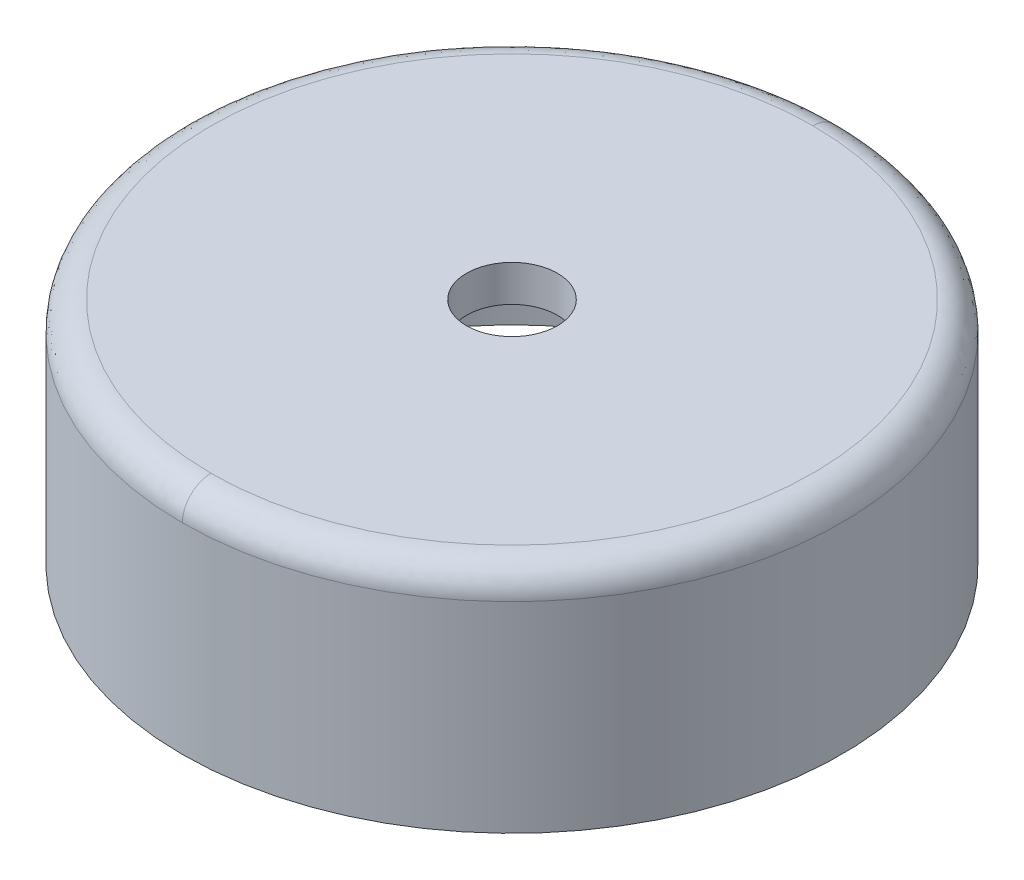
ISO-10303-21;
HEADER;
FILE_DESCRIPTION(('STEP AP214'),'2;1');
FILE_NAME('part.step','',(''),(''),'','','');
FILE_SCHEMA(('AUTOMOTIVE_DESIGN { 1 0 10303 214 1 1 1 1 }'));
ENDSEC;
DATA;
#1=APPLICATION_CONTEXT('core data for automotive mechanical design processes');
#2=APPLICATION_PROTOCOL_DEFINITION('international standard','automotive_design',2000,#1);
#3=PRODUCT_CONTEXT('',#1,'mechanical');
#4=PRODUCT('Part','Part','',(#3));
#5=PRODUCT_RELATED_PRODUCT_CATEGORY('part','',(#4));
#6=PRODUCT_DEFINITION_FORMATION('','',#4);
#7=PRODUCT_DEFINITION_CONTEXT('part definition',#1,'design');
#8=PRODUCT_DEFINITION('design','',#6,#7);
#9=PRODUCT_DEFINITION_SHAPE('','',#8);
#10=(LENGTH_UNIT() NAMED_UNIT(*) SI_UNIT(.MILLI.,.METRE.));
#11=(NAMED_UNIT(*) PLANE_ANGLE_UNIT() SI_UNIT($,.RADIAN.));
#12=(NAMED_UNIT(*) SI_UNIT($,.STERADIAN.) SOLID_ANGLE_UNIT());
#13=UNCERTAINTY_MEASURE_WITH_UNIT(LENGTH_MEASURE(1.E-05),#10,'distance_accuracy_value','');
#14=(GEOMETRIC_REPRESENTATION_CONTEXT(3) GLOBAL_UNCERTAINTY_ASSIGNED_CONTEXT((#13)) GLOBAL_UNIT_ASSIGNED_CONTEXT((#10,
#11,#12)) REPRESENTATION_CONTEXT('',''));
#15=CARTESIAN_POINT('',(0.,0.,0.));
#16=DIRECTION('',(0.,0.,1.));
#17=DIRECTION('',(1.,0.,0.));
#18=AXIS2_PLACEMENT_3D('',#15,#16,#17);
#19=CARTESIAN_POINT('',(-58.19,0.,-58.19));
#20=DIRECTION('',(0.,1.,0.));
#21=DIRECTION('',(0.,0.,1.));
#22=AXIS2_PLACEMENT_3D('',#19,#20,#21);
#23=PLANE('',#22);
#24=CARTESIAN_POINT('',(0.,0.,0.));
#25=DIRECTION('',(0.,-1.,0.));
#26=DIRECTION('',(0.,0.,-1.));
#27=AXIS2_PLACEMENT_3D('',#24,#25,#26);
#28=CIRCLE('',#27,51.15);
#29=CARTESIAN_POINT('',(0.,0.,-51.15));
#30=VERTEX_POINT('',#29);
#31=EDGE_CURVE('E57',#30,#30,#28,.T.);
#32=ORIENTED_EDGE('',*,*,#31,.F.);
#33=EDGE_LOOP('',(#32));
#34=FACE_BOUND('',#33,.T.);
#35=CARTESIAN_POINT('',(0.,0.,0.));
#36=DIRECTION('',(0.,-1.,0.));
#37=DIRECTION('',(0.,0.,-1.));
#38=AXIS2_PLACEMENT_3D('',#35,#36,#37);
#39=CIRCLE('',#38,57.5);
#40=CARTESIAN_POINT('',(0.,0.,-57.5));
#41=VERTEX_POINT('',#40);
#42=EDGE_CURVE('E22',#41,#41,#39,.T.);
#43=ORIENTED_EDGE('',*,*,#42,.T.);
#44=EDGE_LOOP('',(#43));
#45=FACE_BOUND('',#44,.T.);
#46=ADVANCED_FACE('F17',(#34,#45),#23,.F.);
#47=CARTESIAN_POINT('',(0.,35.,0.));
#48=DIRECTION('',(0.,-1.,0.));
#49=DIRECTION('',(0.,0.,-1.));
#50=AXIS2_PLACEMENT_3D('',#47,#48,#49);
#51=CYLINDRICAL_SURFACE('',#50,57.5);
#52=CARTESIAN_POINT('',(0.,35.0000000025078,0.));
#53=DIRECTION('',(0.,1.,0.));
#54=DIRECTION('',(-1.,0.,0.));
#55=AXIS2_PLACEMENT_3D('',#52,#53,#54);
#56=CIRCLE('',#55,57.4999999997125);
#57=CARTESIAN_POINT('',(-2.58156681732607E-09,35.0000000025078,-57.4999999997843));
#58=VERTEX_POINT('',#57);
#59=CARTESIAN_POINT('',(-5.89672356981577E-09,35.0000000018809,57.4999999997843));
#60=VERTEX_POINT('',#59);
#61=EDGE_CURVE('E46',#58,#60,#56,.T.);
#62=ORIENTED_EDGE('',*,*,#61,.F.);
#63=CARTESIAN_POINT('',(0.,35.0000000025078,0.));
#64=DIRECTION('',(0.,1.,0.));
#65=DIRECTION('',(-1.,0.,0.));
#66=AXIS2_PLACEMENT_3D('',#63,#64,#65);
#67=CIRCLE('',#66,57.4999999997125);
#68=EDGE_CURVE('E51',#60,#58,#67,.T.);
#69=ORIENTED_EDGE('',*,*,#68,.F.);
#70=EDGE_LOOP('',(#62,#69));
#71=FACE_BOUND('',#70,.T.);
#72=ORIENTED_EDGE('',*,*,#42,.F.);
#73=EDGE_LOOP('',(#72));
#74=FACE_BOUND('',#73,.T.);
#75=ADVANCED_FACE('F63',(#71,#74),#51,.T.);
#76=CARTESIAN_POINT('',(0.,33.65,0.));
#77=DIRECTION('',(0.,-1.,0.));
#78=DIRECTION('',(0.,0.,-1.));
#79=AXIS2_PLACEMENT_3D('',#76,#77,#78);
#80=CYLINDRICAL_SURFACE('',#79,51.15);
#81=ORIENTED_EDGE('',*,*,#31,.T.);
#82=EDGE_LOOP('',(#81));
#83=FACE_BOUND('',#82,.T.);
#84=CARTESIAN_POINT('',(0.,33.65,0.));
#85=DIRECTION('',(0.,-1.,0.));
#86=DIRECTION('',(0.,0.,-1.));
#87=AXIS2_PLACEMENT_3D('',#84,#85,#86);
#88=CIRCLE('',#87,51.15);
#89=CARTESIAN_POINT('',(0.,33.65,-51.15));
#90=VERTEX_POINT('',#89);
#91=EDGE_CURVE('E66',#90,#90,#88,.F.);
#92=ORIENTED_EDGE('',*,*,#91,.T.);
#93=EDGE_LOOP('',(#92));
#94=FACE_BOUND('',#93,.T.);
#95=ADVANCED_FACE('F100',(#83,#94),#80,.F.);
#96=CARTESIAN_POINT('',(0.,39.975020826,52.000832917));
#97=CARTESIAN_POINT('',(104.001665834,39.975020826,52.000832917));
#98=CARTESIAN_POINT('',(104.001665834,39.975020826,-52.000832917));
#99=CARTESIAN_POINT('',(0.,39.975020826,-52.000832917));
#100=CARTESIAN_POINT('',(0.,40.316102114,55.400268826));
#101=CARTESIAN_POINT('',(110.800537652,40.316102114,55.400268826));
#102=CARTESIAN_POINT('',(110.800537652,40.316102114,-55.400268826));
#103=CARTESIAN_POINT('',(0.,40.316102114,-55.400268826));
#104=CARTESIAN_POINT('',(0.,37.900268826,57.816102114));
#105=CARTESIAN_POINT('',(115.632204227,37.900268826,57.816102114));
#106=CARTESIAN_POINT('',(115.632204227,37.900268826,-57.816102114));
#107=CARTESIAN_POINT('',(0.,37.900268826,-57.816102114));
#108=CARTESIAN_POINT('',(0.,34.500832917,57.475020826));
#109=CARTESIAN_POINT('',(114.950041653,34.500832917,57.475020826));
#110=CARTESIAN_POINT('',(114.950041653,34.500832917,-57.475020826));
#111=CARTESIAN_POINT('',(0.,34.500832917,-57.475020826));
#112=(BOUNDED_SURFACE() B_SPLINE_SURFACE(3,3,((#96,#97,#98,#99),(#100,#101,#102,#103),(#104,
#105,#106,#107),(#108,#109,#110,#111)),.UNSPECIFIED.,.F.,.F.,
.F.) B_SPLINE_SURFACE_WITH_KNOTS((4,4),(4,4),(0.,1.),(0.,1.),
.UNSPECIFIED.) GEOMETRIC_REPRESENTATION_ITEM() RATIONAL_B_SPLINE_SURFACE(((1.,0.333333333333333,
0.333333333333333,1.),(0.755320871117972,0.251773623705991,0.251773623705991,0.755320871117972),
(0.755320871117972,0.251773623705991,0.251773623705991,0.755320871117972),(1.,0.333333333333333,
0.333333333333333,1.))) REPRESENTATION_ITEM('') SURFACE());
#113=CARTESIAN_POINT('',(0.,39.9999999997124,-52.50000000251));
#114=CARTESIAN_POINT('',(105.000000005011,39.9999999997124,-52.50000000251));
#115=CARTESIAN_POINT('',(105.000000005011,39.9999999997124,52.50000000251));
#116=CARTESIAN_POINT('',(0.,39.9999999997124,52.50000000251));
#117=(BOUNDED_CURVE() B_SPLINE_CURVE(3,(#113,#114,#115,#116),.UNSPECIFIED.,.F.,
.F.) B_SPLINE_CURVE_WITH_KNOTS((4,4),(0.,1.),
.UNSPECIFIED.) CURVE() GEOMETRIC_REPRESENTATION_ITEM() RATIONAL_B_SPLINE_CURVE((0.95657830216582,
0.318859434055273,0.318859434055273,0.95657830216582)) REPRESENTATION_ITEM(''));
#118=CARTESIAN_POINT('',(0.,39.9999999998275,52.4999999910896));
#119=VERTEX_POINT('',#118);
#120=CARTESIAN_POINT('',(0.,39.9999999998275,-52.4999999910896));
#121=VERTEX_POINT('',#120);
#122=EDGE_CURVE('E36',#119,#121,#117,.F.);
#123=CARTESIAN_POINT('',(0.,39.975020826,52.000832917));
#124=CARTESIAN_POINT('',(0.,40.316102114,55.400268826));
#125=CARTESIAN_POINT('',(0.,37.900268826,57.816102114));
#126=CARTESIAN_POINT('',(0.,34.500832917,57.475020826));
#127=(BOUNDED_CURVE() B_SPLINE_CURVE(3,(#123,#124,#125,#126),.UNSPECIFIED.,.F.,
.F.) B_SPLINE_CURVE_WITH_KNOTS((4,4),(0.,1.),
.UNSPECIFIED.) CURVE() GEOMETRIC_REPRESENTATION_ITEM() RATIONAL_B_SPLINE_CURVE((1.,
0.755320871117972,0.755320871117972,1.)) REPRESENTATION_ITEM(''));
#128=EDGE_CURVE('E55',#60,#119,#127,.F.);
#129=CARTESIAN_POINT('',(0.,39.975020826,-52.000832917));
#130=CARTESIAN_POINT('',(0.,40.316102114,-55.400268826));
#131=CARTESIAN_POINT('',(0.,37.900268826,-57.816102114));
#132=CARTESIAN_POINT('',(0.,34.500832917,-57.475020826));
#133=(BOUNDED_CURVE() B_SPLINE_CURVE(3,(#129,#130,#131,#132),.UNSPECIFIED.,.F.,
.F.) B_SPLINE_CURVE_WITH_KNOTS((4,4),(0.,1.),
.UNSPECIFIED.) CURVE() GEOMETRIC_REPRESENTATION_ITEM() RATIONAL_B_SPLINE_CURVE((1.,
0.755320871117972,0.755320871117972,1.)) REPRESENTATION_ITEM(''));
#134=EDGE_CURVE('E53',#121,#58,#133,.T.);
#135=ORIENTED_EDGE('',*,*,#122,.F.);
#136=ORIENTED_EDGE('',*,*,#128,.F.);
#137=ORIENTED_EDGE('',*,*,#68,.T.);
#138=ORIENTED_EDGE('',*,*,#134,.F.);
#139=EDGE_LOOP('',(#135,#136,#137,#138));
#140=FACE_BOUND('',#139,.T.);
#141=ADVANCED_FACE('F52',(#140),#112,.T.);
#142=CARTESIAN_POINT('',(0.,39.975020826,-52.000832917));
#143=CARTESIAN_POINT('',(-104.001665834,39.975020826,-52.000832917));
#144=CARTESIAN_POINT('',(-104.001665834,39.975020826,52.000832917));
#145=CARTESIAN_POINT('',(0.,39.975020826,52.000832917));
#146=CARTESIAN_POINT('',(0.,40.316102114,-55.400268826));
#147=CARTESIAN_POINT('',(-110.800537652,40.316102114,-55.400268826));
#148=CARTESIAN_POINT('',(-110.800537652,40.316102114,55.400268826));
#149=CARTESIAN_POINT('',(0.,40.316102114,55.400268826));
#150=CARTESIAN_POINT('',(0.,37.900268826,-57.816102114));
#151=CARTESIAN_POINT('',(-115.632204227,37.900268826,-57.816102114));
#152=CARTESIAN_POINT('',(-115.632204227,37.900268826,57.816102114));
#153=CARTESIAN_POINT('',(0.,37.900268826,57.816102114));
#154=CARTESIAN_POINT('',(0.,34.500832917,-57.475020826));
#155=CARTESIAN_POINT('',(-114.950041653,34.500832917,-57.475020826));
#156=CARTESIAN_POINT('',(-114.950041653,34.500832917,57.475020826));
#157=CARTESIAN_POINT('',(0.,34.500832917,57.475020826));
#158=(BOUNDED_SURFACE() B_SPLINE_SURFACE(3,3,((#142,#143,#144,#145),(#146,#147,#148,#149),(#150,
#151,#152,#153),(#154,#155,#156,#157)),.UNSPECIFIED.,.F.,.F.,
.F.) B_SPLINE_SURFACE_WITH_KNOTS((4,4),(4,4),(0.,1.),(0.,1.),
.UNSPECIFIED.) GEOMETRIC_REPRESENTATION_ITEM() RATIONAL_B_SPLINE_SURFACE(((1.,0.333333333333333,
0.333333333333333,1.),(0.755320871117972,0.251773623705991,0.251773623705991,0.755320871117972),
(0.755320871117972,0.251773623705991,0.251773623705991,0.755320871117972),(1.,0.333333333333333,
0.333333333333333,1.))) REPRESENTATION_ITEM('') SURFACE());
#159=CARTESIAN_POINT('',(0.,39.9999999997125,52.50000000251));
#160=CARTESIAN_POINT('',(-105.000000005011,39.9999999997125,52.50000000251));
#161=CARTESIAN_POINT('',(-105.000000005011,39.9999999997125,-52.50000000251));
#162=CARTESIAN_POINT('',(0.,39.9999999997125,-52.50000000251));
#163=(BOUNDED_CURVE() B_SPLINE_CURVE(3,(#159,#160,#161,#162),.UNSPECIFIED.,.F.,
.F.) B_SPLINE_CURVE_WITH_KNOTS((4,4),(0.,1.),
.UNSPECIFIED.) CURVE() GEOMETRIC_REPRESENTATION_ITEM() RATIONAL_B_SPLINE_CURVE((0.95657830216582,
0.318859434055273,0.318859434055273,0.95657830216582)) REPRESENTATION_ITEM(''));
#164=EDGE_CURVE('E60',#121,#119,#163,.F.);
#165=ORIENTED_EDGE('',*,*,#128,.T.);
#166=ORIENTED_EDGE('',*,*,#164,.F.);
#167=ORIENTED_EDGE('',*,*,#134,.T.);
#168=ORIENTED_EDGE('',*,*,#61,.T.);
#169=EDGE_LOOP('',(#165,#166,#167,#168));
#170=FACE_BOUND('',#169,.T.);
#171=ADVANCED_FACE('F59',(#170),#158,.T.);
#172=CARTESIAN_POINT('',(-51.7638,33.65,-51.7638));
#173=DIRECTION('',(0.,1.,0.));
#174=DIRECTION('',(0.,0.,1.));
#175=AXIS2_PLACEMENT_3D('',#172,#173,#174);
#176=PLANE('',#175);
#177=CARTESIAN_POINT('',(0.,33.65,0.));
#178=DIRECTION('',(0.,1.,0.));
#179=DIRECTION('',(0.,0.,1.));
#180=AXIS2_PLACEMENT_3D('',#177,#178,#179);
#181=CIRCLE('',#180,7.9375);
#182=CARTESIAN_POINT('',(0.,33.65,7.9375));
#183=VERTEX_POINT('',#182);
#184=EDGE_CURVE('E28',#183,#183,#181,.F.);
#185=ORIENTED_EDGE('',*,*,#184,.F.);
#186=EDGE_LOOP('',(#185));
#187=FACE_BOUND('',#186,.T.);
#188=ORIENTED_EDGE('',*,*,#91,.F.);
#189=EDGE_LOOP('',(#188));
#190=FACE_BOUND('',#189,.T.);
#191=ADVANCED_FACE('F117',(#187,#190),#176,.F.);
#192=CARTESIAN_POINT('',(-53.13,40.,-53.13));
#193=DIRECTION('',(0.,1.,0.));
#194=DIRECTION('',(0.,0.,1.));
#195=AXIS2_PLACEMENT_3D('',#192,#193,#194);
#196=PLANE('',#195);
#197=CARTESIAN_POINT('',(0.,40.,0.));
#198=DIRECTION('',(0.,1.,0.));
#199=DIRECTION('',(0.,0.,1.));
#200=AXIS2_PLACEMENT_3D('',#197,#198,#199);
#201=CIRCLE('',#200,7.9375);
#202=CARTESIAN_POINT('',(0.,40.,7.9375));
#203=VERTEX_POINT('',#202);
#204=EDGE_CURVE('E11',#203,#203,#201,.T.);
#205=ORIENTED_EDGE('',*,*,#204,.F.);
#206=EDGE_LOOP('',(#205));
#207=FACE_BOUND('',#206,.T.);
#208=ORIENTED_EDGE('',*,*,#122,.T.);
#209=ORIENTED_EDGE('',*,*,#164,.T.);
#210=EDGE_LOOP('',(#208,#209));
#211=FACE_BOUND('',#210,.T.);
#212=ADVANCED_FACE('F19',(#207,#211),#196,.T.);
#213=CARTESIAN_POINT('',(0.,33.65,0.));
#214=DIRECTION('',(0.,1.,0.));
#215=DIRECTION('',(0.,0.,1.));
#216=AXIS2_PLACEMENT_3D('',#213,#214,#215);
#217=CYLINDRICAL_SURFACE('',#216,7.9375);
#218=ORIENTED_EDGE('',*,*,#204,.T.);
#219=EDGE_LOOP('',(#218));
#220=FACE_BOUND('',#219,.T.);
#221=ORIENTED_EDGE('',*,*,#184,.T.);
#222=EDGE_LOOP('',(#221));
#223=FACE_BOUND('',#222,.T.);
#224=ADVANCED_FACE('F110',(#220,#223),#217,.F.);
#225=CLOSED_SHELL('',(#46,#75,#95,#141,#171,#191,#212,#224));
#226=MANIFOLD_SOLID_BREP('B1',#225);
#227=ADVANCED_BREP_SHAPE_REPRESENTATION('',(#18,#226),#14);
#228=SHAPE_DEFINITION_REPRESENTATION(#9,#227);
ENDSEC;
END-ISO-10303-21;
